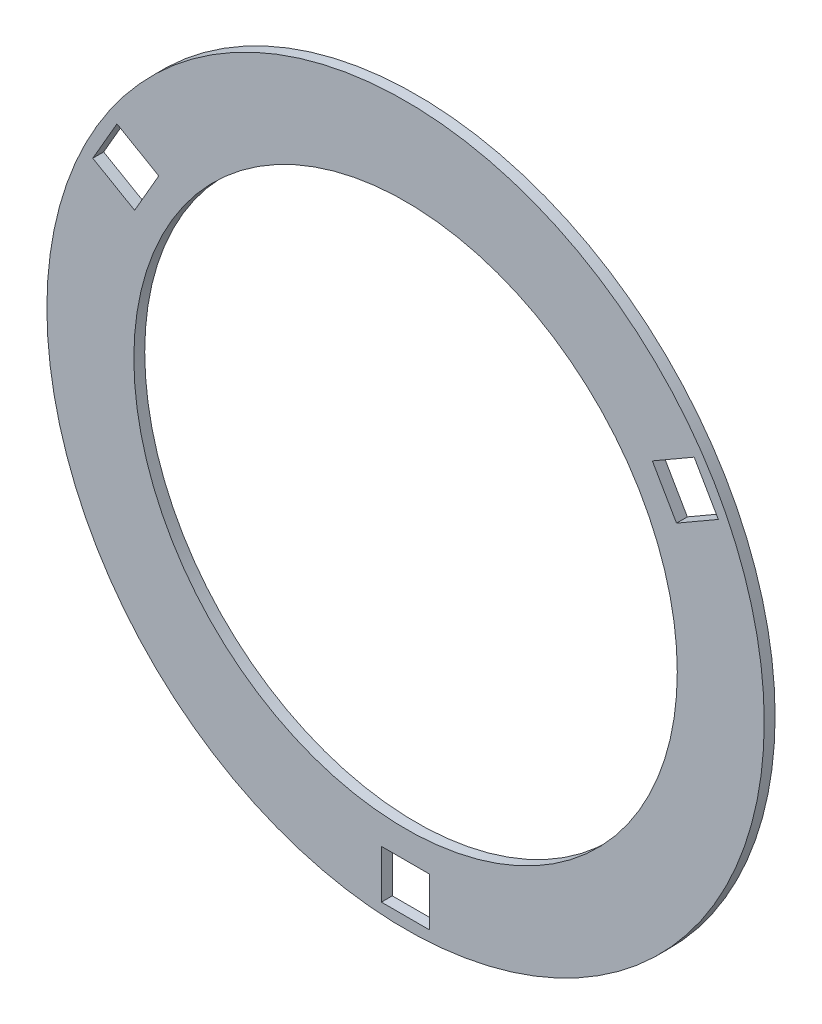
ISO-10303-21;
HEADER;
FILE_DESCRIPTION(('STEP AP214'),'2;1');
FILE_NAME('part.step','',(''),(''),'','','');
FILE_SCHEMA(('AUTOMOTIVE_DESIGN { 1 0 10303 214 1 1 1 1 }'));
ENDSEC;
DATA;
#1=APPLICATION_CONTEXT('core data for automotive mechanical design processes');
#2=APPLICATION_PROTOCOL_DEFINITION('international standard','automotive_design',2000,#1);
#3=PRODUCT_CONTEXT('',#1,'mechanical');
#4=PRODUCT('Part','Part','',(#3));
#5=PRODUCT_RELATED_PRODUCT_CATEGORY('part','',(#4));
#6=PRODUCT_DEFINITION_FORMATION('','',#4);
#7=PRODUCT_DEFINITION_CONTEXT('part definition',#1,'design');
#8=PRODUCT_DEFINITION('design','',#6,#7);
#9=PRODUCT_DEFINITION_SHAPE('','',#8);
#10=(LENGTH_UNIT() NAMED_UNIT(*) SI_UNIT(.MILLI.,.METRE.));
#11=(NAMED_UNIT(*) PLANE_ANGLE_UNIT() SI_UNIT($,.RADIAN.));
#12=(NAMED_UNIT(*) SI_UNIT($,.STERADIAN.) SOLID_ANGLE_UNIT());
#13=UNCERTAINTY_MEASURE_WITH_UNIT(LENGTH_MEASURE(1.E-05),#10,'distance_accuracy_value','');
#14=(GEOMETRIC_REPRESENTATION_CONTEXT(3) GLOBAL_UNCERTAINTY_ASSIGNED_CONTEXT((#13)) GLOBAL_UNIT_ASSIGNED_CONTEXT((#10,
#11,#12)) REPRESENTATION_CONTEXT('',''));
#15=CARTESIAN_POINT('',(0.,0.,0.));
#16=DIRECTION('',(0.,0.,1.));
#17=DIRECTION('',(1.,0.,0.));
#18=AXIS2_PLACEMENT_3D('',#15,#16,#17);
#19=CARTESIAN_POINT('',(-7.25747388281292,-45.0519952390209,10.));
#20=DIRECTION('',(0.,0.,1.));
#21=DIRECTION('',(1.,0.,0.));
#22=AXIS2_PLACEMENT_3D('',#19,#20,#21);
#23=PLANE('',#22);
#24=DIRECTION('',(-0.866025403784439,-0.5,0.));
#25=VECTOR('',#24,1.);
#26=CARTESIAN_POINT('',(258.281841356132,133.920419360085,10.));
#27=LINE('',#26,#25);
#28=CARTESIAN_POINT('',(258.281841356132,133.920419360085,10.));
#29=VERTEX_POINT('',#28);
#30=CARTESIAN_POINT('',(219.787012157914,111.695419360085,10.));
#31=VERTEX_POINT('',#30);
#32=EDGE_CURVE('E160',#29,#31,#27,.T.);
#33=ORIENTED_EDGE('',*,*,#32,.F.);
#34=DIRECTION('',(-0.5,0.866025403784439,0.));
#35=VECTOR('',#34,1.);
#36=CARTESIAN_POINT('',(280.506841356132,95.4255901618662,10.));
#37=LINE('',#36,#35);
#38=CARTESIAN_POINT('',(280.506841356132,95.4255901618662,10.));
#39=VERTEX_POINT('',#38);
#40=EDGE_CURVE('E158',#39,#29,#37,.T.);
#41=ORIENTED_EDGE('',*,*,#40,.F.);
#42=DIRECTION('',(0.866025403784439,0.5,0.));
#43=VECTOR('',#42,1.);
#44=CARTESIAN_POINT('',(242.012012157914,73.2005901618663,10.));
#45=LINE('',#44,#43);
#46=CARTESIAN_POINT('',(242.012012157914,73.2005901618662,10.));
#47=VERTEX_POINT('',#46);
#48=EDGE_CURVE('E166',#47,#39,#45,.T.);
#49=ORIENTED_EDGE('',*,*,#48,.F.);
#50=DIRECTION('',(0.5,-0.866025403784439,0.));
#51=VECTOR('',#50,1.);
#52=CARTESIAN_POINT('',(219.787012157914,111.695419360085,10.));
#53=LINE('',#52,#51);
#54=EDGE_CURVE('E163',#31,#47,#53,.T.);
#55=ORIENTED_EDGE('',*,*,#54,.F.);
#56=EDGE_LOOP('',(#33,#41,#49,#55));
#57=FACE_BOUND('',#56,.T.);
#58=CARTESIAN_POINT('',(-7.25747388281292,-45.0519952390209,10.));
#59=DIRECTION('',(0.,0.,1.));
#60=DIRECTION('',(1.,0.,0.));
#61=AXIS2_PLACEMENT_3D('',#58,#59,#60);
#62=CIRCLE('',#61,250.);
#63=CARTESIAN_POINT('',(242.742526117187,-45.0519952390209,10.));
#64=VERTEX_POINT('',#63);
#65=EDGE_CURVE('E220',#64,#64,#62,.T.);
#66=ORIENTED_EDGE('',*,*,#65,.F.);
#67=EDGE_LOOP('',(#66));
#68=FACE_BOUND('',#67,.T.);
#69=CARTESIAN_POINT('',(-7.25747388281292,-45.0519952390209,10.));
#70=DIRECTION('',(0.,0.,1.));
#71=DIRECTION('',(1.,0.,0.));
#72=AXIS2_PLACEMENT_3D('',#69,#70,#71);
#73=CIRCLE('',#72,330.);
#74=CARTESIAN_POINT('',(322.742526117187,-45.0519952390209,10.));
#75=VERTEX_POINT('',#74);
#76=EDGE_CURVE('E11',#75,#75,#73,.T.);
#77=ORIENTED_EDGE('',*,*,#76,.T.);
#78=EDGE_LOOP('',(#77));
#79=FACE_BOUND('',#78,.T.);
#80=DIRECTION('',(-0.5,-0.866025403784439,0.));
#81=VECTOR('',#80,1.);
#82=CARTESIAN_POINT('',(-272.796789121746,133.920419360092,10.));
#83=LINE('',#82,#81);
#84=CARTESIAN_POINT('',(-272.796789121746,133.920419360092,10.));
#85=VERTEX_POINT('',#84);
#86=CARTESIAN_POINT('',(-295.021789121746,95.4255901618734,10.));
#87=VERTEX_POINT('',#86);
#88=EDGE_CURVE('E191',#85,#87,#83,.T.);
#89=ORIENTED_EDGE('',*,*,#88,.F.);
#90=DIRECTION('',(-0.866025403784439,0.5,0.));
#91=VECTOR('',#90,1.);
#92=CARTESIAN_POINT('',(-234.301959923527,111.695419360092,10.));
#93=LINE('',#92,#91);
#94=CARTESIAN_POINT('',(-234.301959923527,111.695419360092,10.));
#95=VERTEX_POINT('',#94);
#96=EDGE_CURVE('E189',#95,#85,#93,.T.);
#97=ORIENTED_EDGE('',*,*,#96,.F.);
#98=DIRECTION('',(0.5,0.866025403784439,0.));
#99=VECTOR('',#98,1.);
#100=CARTESIAN_POINT('',(-256.526959923527,73.2005901618734,10.));
#101=LINE('',#100,#99);
#102=CARTESIAN_POINT('',(-256.526959923527,73.2005901618734,10.));
#103=VERTEX_POINT('',#102);
#104=EDGE_CURVE('E197',#103,#95,#101,.T.);
#105=ORIENTED_EDGE('',*,*,#104,.F.);
#106=DIRECTION('',(0.866025403784439,-0.5,0.));
#107=VECTOR('',#106,1.);
#108=CARTESIAN_POINT('',(-295.021789121746,95.4255901618734,10.));
#109=LINE('',#108,#107);
#110=EDGE_CURVE('E194',#87,#103,#109,.T.);
#111=ORIENTED_EDGE('',*,*,#110,.F.);
#112=EDGE_LOOP('',(#89,#97,#105,#111));
#113=FACE_BOUND('',#112,.T.);
#114=DIRECTION('',(0.,-1.,0.));
#115=VECTOR('',#114,1.);
#116=CARTESIAN_POINT('',(-29.4824738828129,-320.051995239021,10.));
#117=LINE('',#116,#115);
#118=CARTESIAN_POINT('',(-29.4824738828129,-320.051995239021,10.));
#119=VERTEX_POINT('',#118);
#120=CARTESIAN_POINT('',(-29.4824738828129,-364.501995239021,10.));
#121=VERTEX_POINT('',#120);
#122=EDGE_CURVE('E130',#119,#121,#117,.T.);
#123=ORIENTED_EDGE('',*,*,#122,.F.);
#124=DIRECTION('',(-1.,0.,0.));
#125=VECTOR('',#124,1.);
#126=CARTESIAN_POINT('',(14.9675261171871,-320.051995239021,10.));
#127=LINE('',#126,#125);
#128=CARTESIAN_POINT('',(14.9675261171871,-320.051995239021,10.));
#129=VERTEX_POINT('',#128);
#130=EDGE_CURVE('E122',#129,#119,#127,.T.);
#131=ORIENTED_EDGE('',*,*,#130,.F.);
#132=DIRECTION('',(0.,1.,0.));
#133=VECTOR('',#132,1.);
#134=CARTESIAN_POINT('',(14.9675261171871,-364.501995239021,10.));
#135=LINE('',#134,#133);
#136=CARTESIAN_POINT('',(14.9675261171871,-364.501995239021,10.));
#137=VERTEX_POINT('',#136);
#138=EDGE_CURVE('E144',#137,#129,#135,.T.);
#139=ORIENTED_EDGE('',*,*,#138,.F.);
#140=DIRECTION('',(1.,0.,0.));
#141=VECTOR('',#140,1.);
#142=CARTESIAN_POINT('',(-29.4824738828129,-364.501995239021,10.));
#143=LINE('',#142,#141);
#144=EDGE_CURVE('E142',#121,#137,#143,.T.);
#145=ORIENTED_EDGE('',*,*,#144,.F.);
#146=EDGE_LOOP('',(#123,#131,#139,#145));
#147=FACE_BOUND('',#146,.T.);
#148=ADVANCED_FACE('F33',(#57,#68,#79,#113,#147),#23,.T.);
#149=CARTESIAN_POINT('',(-7.25747388281292,-45.0519952390209,0.));
#150=DIRECTION('',(0.,0.,1.));
#151=DIRECTION('',(1.,0.,0.));
#152=AXIS2_PLACEMENT_3D('',#149,#150,#151);
#153=PLANE('',#152);
#154=DIRECTION('',(-0.5,0.866025403784439,0.));
#155=VECTOR('',#154,1.);
#156=CARTESIAN_POINT('',(280.506841356132,95.4255901618662,0.));
#157=LINE('',#156,#155);
#158=CARTESIAN_POINT('',(280.506841356132,95.4255901618662,0.));
#159=VERTEX_POINT('',#158);
#160=CARTESIAN_POINT('',(258.281841356132,133.920419360085,0.));
#161=VERTEX_POINT('',#160);
#162=EDGE_CURVE('E138',#159,#161,#157,.T.);
#163=ORIENTED_EDGE('',*,*,#162,.T.);
#164=DIRECTION('',(-0.866025403784439,-0.5,0.));
#165=VECTOR('',#164,1.);
#166=CARTESIAN_POINT('',(258.281841356132,133.920419360085,0.));
#167=LINE('',#166,#165);
#168=CARTESIAN_POINT('',(219.787012157914,111.695419360085,0.));
#169=VERTEX_POINT('',#168);
#170=EDGE_CURVE('E171',#161,#169,#167,.T.);
#171=ORIENTED_EDGE('',*,*,#170,.T.);
#172=DIRECTION('',(0.5,-0.866025403784439,0.));
#173=VECTOR('',#172,1.);
#174=CARTESIAN_POINT('',(219.787012157914,111.695419360085,0.));
#175=LINE('',#174,#173);
#176=CARTESIAN_POINT('',(242.012012157914,73.2005901618663,0.));
#177=VERTEX_POINT('',#176);
#178=EDGE_CURVE('E174',#169,#177,#175,.T.);
#179=ORIENTED_EDGE('',*,*,#178,.T.);
#180=DIRECTION('',(0.866025403784439,0.5,0.));
#181=VECTOR('',#180,1.);
#182=CARTESIAN_POINT('',(242.012012157914,73.2005901618663,0.));
#183=LINE('',#182,#181);
#184=EDGE_CURVE('E161',#177,#159,#183,.T.);
#185=ORIENTED_EDGE('',*,*,#184,.T.);
#186=EDGE_LOOP('',(#163,#171,#179,#185));
#187=FACE_BOUND('',#186,.T.);
#188=CARTESIAN_POINT('',(-7.25747388281292,-45.0519952390209,0.));
#189=DIRECTION('',(0.,0.,1.));
#190=DIRECTION('',(1.,0.,0.));
#191=AXIS2_PLACEMENT_3D('',#188,#189,#190);
#192=CIRCLE('',#191,250.);
#193=CARTESIAN_POINT('',(242.742526117187,-45.0519952390209,0.));
#194=VERTEX_POINT('',#193);
#195=EDGE_CURVE('E219',#194,#194,#192,.T.);
#196=ORIENTED_EDGE('',*,*,#195,.T.);
#197=EDGE_LOOP('',(#196));
#198=FACE_BOUND('',#197,.T.);
#199=CARTESIAN_POINT('',(-7.25747388281292,-45.0519952390209,0.));
#200=DIRECTION('',(0.,0.,1.));
#201=DIRECTION('',(1.,0.,0.));
#202=AXIS2_PLACEMENT_3D('',#199,#200,#201);
#203=CIRCLE('',#202,330.);
#204=CARTESIAN_POINT('',(322.742526117187,-45.0519952390209,0.));
#205=VERTEX_POINT('',#204);
#206=EDGE_CURVE('E37',#205,#205,#203,.T.);
#207=ORIENTED_EDGE('',*,*,#206,.F.);
#208=EDGE_LOOP('',(#207));
#209=FACE_BOUND('',#208,.T.);
#210=DIRECTION('',(-0.866025403784439,0.5,0.));
#211=VECTOR('',#210,1.);
#212=CARTESIAN_POINT('',(-234.301959923527,111.695419360092,0.));
#213=LINE('',#212,#211);
#214=CARTESIAN_POINT('',(-234.301959923527,111.695419360092,0.));
#215=VERTEX_POINT('',#214);
#216=CARTESIAN_POINT('',(-272.796789121746,133.920419360092,0.));
#217=VERTEX_POINT('',#216);
#218=EDGE_CURVE('E188',#215,#217,#213,.T.);
#219=ORIENTED_EDGE('',*,*,#218,.T.);
#220=DIRECTION('',(-0.5,-0.866025403784439,0.));
#221=VECTOR('',#220,1.);
#222=CARTESIAN_POINT('',(-272.796789121746,133.920419360092,0.));
#223=LINE('',#222,#221);
#224=CARTESIAN_POINT('',(-295.021789121746,95.4255901618734,0.));
#225=VERTEX_POINT('',#224);
#226=EDGE_CURVE('E202',#217,#225,#223,.T.);
#227=ORIENTED_EDGE('',*,*,#226,.T.);
#228=DIRECTION('',(0.866025403784439,-0.5,0.));
#229=VECTOR('',#228,1.);
#230=CARTESIAN_POINT('',(-295.021789121746,95.4255901618734,0.));
#231=LINE('',#230,#229);
#232=CARTESIAN_POINT('',(-256.526959923527,73.2005901618734,0.));
#233=VERTEX_POINT('',#232);
#234=EDGE_CURVE('E205',#225,#233,#231,.T.);
#235=ORIENTED_EDGE('',*,*,#234,.T.);
#236=DIRECTION('',(0.5,0.866025403784439,0.));
#237=VECTOR('',#236,1.);
#238=CARTESIAN_POINT('',(-256.526959923527,73.2005901618734,0.));
#239=LINE('',#238,#237);
#240=EDGE_CURVE('E192',#233,#215,#239,.T.);
#241=ORIENTED_EDGE('',*,*,#240,.T.);
#242=EDGE_LOOP('',(#219,#227,#235,#241));
#243=FACE_BOUND('',#242,.T.);
#244=DIRECTION('',(-1.,0.,0.));
#245=VECTOR('',#244,1.);
#246=CARTESIAN_POINT('',(14.9675261171871,-320.051995239021,0.));
#247=LINE('',#246,#245);
#248=CARTESIAN_POINT('',(14.9675261171871,-320.051995239021,0.));
#249=VERTEX_POINT('',#248);
#250=CARTESIAN_POINT('',(-29.4824738828129,-320.051995239021,0.));
#251=VERTEX_POINT('',#250);
#252=EDGE_CURVE('E56',#249,#251,#247,.T.);
#253=ORIENTED_EDGE('',*,*,#252,.T.);
#254=DIRECTION('',(0.,-1.,0.));
#255=VECTOR('',#254,1.);
#256=CARTESIAN_POINT('',(-29.4824738828129,-320.051995239021,0.));
#257=LINE('',#256,#255);
#258=CARTESIAN_POINT('',(-29.4824738828129,-364.501995239021,0.));
#259=VERTEX_POINT('',#258);
#260=EDGE_CURVE('E137',#251,#259,#257,.T.);
#261=ORIENTED_EDGE('',*,*,#260,.T.);
#262=DIRECTION('',(1.,0.,0.));
#263=VECTOR('',#262,1.);
#264=CARTESIAN_POINT('',(-29.4824738828129,-364.501995239021,0.));
#265=LINE('',#264,#263);
#266=CARTESIAN_POINT('',(14.9675261171871,-364.501995239021,0.));
#267=VERTEX_POINT('',#266);
#268=EDGE_CURVE('E150',#259,#267,#265,.T.);
#269=ORIENTED_EDGE('',*,*,#268,.T.);
#270=DIRECTION('',(0.,1.,0.));
#271=VECTOR('',#270,1.);
#272=CARTESIAN_POINT('',(14.9675261171871,-364.501995239021,0.));
#273=LINE('',#272,#271);
#274=EDGE_CURVE('E131',#267,#249,#273,.T.);
#275=ORIENTED_EDGE('',*,*,#274,.T.);
#276=EDGE_LOOP('',(#253,#261,#269,#275));
#277=FACE_BOUND('',#276,.T.);
#278=ADVANCED_FACE('F226',(#187,#198,#209,#243,#277),#153,.F.);
#279=CARTESIAN_POINT('',(-7.25747388281292,-45.0519952390209,10.));
#280=DIRECTION('',(0.,0.,-1.));
#281=DIRECTION('',(-1.,0.,0.));
#282=AXIS2_PLACEMENT_3D('',#279,#280,#281);
#283=CYLINDRICAL_SURFACE('',#282,330.);
#284=ORIENTED_EDGE('',*,*,#76,.F.);
#285=EDGE_LOOP('',(#284));
#286=FACE_BOUND('',#285,.T.);
#287=ORIENTED_EDGE('',*,*,#206,.T.);
#288=EDGE_LOOP('',(#287));
#289=FACE_BOUND('',#288,.T.);
#290=ADVANCED_FACE('F35',(#286,#289),#283,.T.);
#291=CARTESIAN_POINT('',(-7.25747388281292,-45.0519952390209,10.));
#292=DIRECTION('',(0.,0.,-1.));
#293=DIRECTION('',(-1.,0.,0.));
#294=AXIS2_PLACEMENT_3D('',#291,#292,#293);
#295=CYLINDRICAL_SURFACE('',#294,250.);
#296=ORIENTED_EDGE('',*,*,#65,.T.);
#297=EDGE_LOOP('',(#296));
#298=FACE_BOUND('',#297,.T.);
#299=ORIENTED_EDGE('',*,*,#195,.F.);
#300=EDGE_LOOP('',(#299));
#301=FACE_BOUND('',#300,.T.);
#302=ADVANCED_FACE('F229',(#298,#301),#295,.F.);
#303=CARTESIAN_POINT('',(-234.301959923527,111.695419360092,10.));
#304=DIRECTION('',(-0.5,-0.866025403784439,0.));
#305=DIRECTION('',(0.866025403784439,-0.5,0.));
#306=AXIS2_PLACEMENT_3D('',#303,#304,#305);
#307=PLANE('',#306);
#308=ORIENTED_EDGE('',*,*,#218,.F.);
#309=DIRECTION('',(0.,0.,-1.));
#310=VECTOR('',#309,1.);
#311=CARTESIAN_POINT('',(-234.301959923527,111.695419360092,10.));
#312=LINE('',#311,#310);
#313=EDGE_CURVE('E199',#95,#215,#312,.T.);
#314=ORIENTED_EDGE('',*,*,#313,.F.);
#315=ORIENTED_EDGE('',*,*,#96,.T.);
#316=DIRECTION('',(0.,0.,-1.));
#317=VECTOR('',#316,1.);
#318=CARTESIAN_POINT('',(-272.796789121746,133.920419360092,10.));
#319=LINE('',#318,#317);
#320=EDGE_CURVE('E216',#85,#217,#319,.T.);
#321=ORIENTED_EDGE('',*,*,#320,.T.);
#322=EDGE_LOOP('',(#308,#314,#315,#321));
#323=FACE_BOUND('',#322,.T.);
#324=ADVANCED_FACE('F231',(#323),#307,.T.);
#325=CARTESIAN_POINT('',(-272.796789121746,133.920419360092,10.));
#326=DIRECTION('',(0.866025403784439,-0.5,0.));
#327=DIRECTION('',(0.5,0.866025403784439,0.));
#328=AXIS2_PLACEMENT_3D('',#325,#326,#327);
#329=PLANE('',#328);
#330=ORIENTED_EDGE('',*,*,#226,.F.);
#331=ORIENTED_EDGE('',*,*,#320,.F.);
#332=ORIENTED_EDGE('',*,*,#88,.T.);
#333=DIRECTION('',(0.,0.,-1.));
#334=VECTOR('',#333,1.);
#335=CARTESIAN_POINT('',(-295.021789121746,95.4255901618734,10.));
#336=LINE('',#335,#334);
#337=EDGE_CURVE('E214',#87,#225,#336,.T.);
#338=ORIENTED_EDGE('',*,*,#337,.T.);
#339=EDGE_LOOP('',(#330,#331,#332,#338));
#340=FACE_BOUND('',#339,.T.);
#341=ADVANCED_FACE('F238',(#340),#329,.T.);
#342=CARTESIAN_POINT('',(-295.021789121746,95.4255901618734,10.));
#343=DIRECTION('',(0.5,0.866025403784439,0.));
#344=DIRECTION('',(-0.866025403784439,0.5,0.));
#345=AXIS2_PLACEMENT_3D('',#342,#343,#344);
#346=PLANE('',#345);
#347=ORIENTED_EDGE('',*,*,#234,.F.);
#348=ORIENTED_EDGE('',*,*,#337,.F.);
#349=ORIENTED_EDGE('',*,*,#110,.T.);
#350=DIRECTION('',(0.,0.,-1.));
#351=VECTOR('',#350,1.);
#352=CARTESIAN_POINT('',(-256.526959923527,73.2005901618734,10.));
#353=LINE('',#352,#351);
#354=EDGE_CURVE('E212',#103,#233,#353,.T.);
#355=ORIENTED_EDGE('',*,*,#354,.T.);
#356=EDGE_LOOP('',(#347,#348,#349,#355));
#357=FACE_BOUND('',#356,.T.);
#358=ADVANCED_FACE('F266',(#357),#346,.T.);
#359=CARTESIAN_POINT('',(-256.526959923527,73.2005901618734,10.));
#360=DIRECTION('',(-0.866025403784439,0.5,0.));
#361=DIRECTION('',(-0.5,-0.866025403784439,0.));
#362=AXIS2_PLACEMENT_3D('',#359,#360,#361);
#363=PLANE('',#362);
#364=ORIENTED_EDGE('',*,*,#240,.F.);
#365=ORIENTED_EDGE('',*,*,#354,.F.);
#366=ORIENTED_EDGE('',*,*,#104,.T.);
#367=ORIENTED_EDGE('',*,*,#313,.T.);
#368=EDGE_LOOP('',(#364,#365,#366,#367));
#369=FACE_BOUND('',#368,.T.);
#370=ADVANCED_FACE('F272',(#369),#363,.T.);
#371=CARTESIAN_POINT('',(280.506841356132,95.4255901618662,10.));
#372=DIRECTION('',(-0.866025403784439,-0.5,0.));
#373=DIRECTION('',(0.5,-0.866025403784439,0.));
#374=AXIS2_PLACEMENT_3D('',#371,#372,#373);
#375=PLANE('',#374);
#376=ORIENTED_EDGE('',*,*,#162,.F.);
#377=DIRECTION('',(0.,0.,-1.));
#378=VECTOR('',#377,1.);
#379=CARTESIAN_POINT('',(280.506841356132,95.4255901618662,10.));
#380=LINE('',#379,#378);
#381=EDGE_CURVE('E168',#39,#159,#380,.T.);
#382=ORIENTED_EDGE('',*,*,#381,.F.);
#383=ORIENTED_EDGE('',*,*,#40,.T.);
#384=DIRECTION('',(0.,0.,-1.));
#385=VECTOR('',#384,1.);
#386=CARTESIAN_POINT('',(258.281841356132,133.920419360085,10.));
#387=LINE('',#386,#385);
#388=EDGE_CURVE('E185',#29,#161,#387,.T.);
#389=ORIENTED_EDGE('',*,*,#388,.T.);
#390=EDGE_LOOP('',(#376,#382,#383,#389));
#391=FACE_BOUND('',#390,.T.);
#392=ADVANCED_FACE('F274',(#391),#375,.T.);
#393=CARTESIAN_POINT('',(258.281841356132,133.920419360085,10.));
#394=DIRECTION('',(0.5,-0.866025403784439,0.));
#395=DIRECTION('',(0.866025403784439,0.5,0.));
#396=AXIS2_PLACEMENT_3D('',#393,#394,#395);
#397=PLANE('',#396);
#398=ORIENTED_EDGE('',*,*,#170,.F.);
#399=ORIENTED_EDGE('',*,*,#388,.F.);
#400=ORIENTED_EDGE('',*,*,#32,.T.);
#401=DIRECTION('',(0.,0.,-1.));
#402=VECTOR('',#401,1.);
#403=CARTESIAN_POINT('',(219.787012157914,111.695419360085,10.));
#404=LINE('',#403,#402);
#405=EDGE_CURVE('E183',#31,#169,#404,.T.);
#406=ORIENTED_EDGE('',*,*,#405,.T.);
#407=EDGE_LOOP('',(#398,#399,#400,#406));
#408=FACE_BOUND('',#407,.T.);
#409=ADVANCED_FACE('F280',(#408),#397,.T.);
#410=CARTESIAN_POINT('',(219.787012157914,111.695419360085,10.));
#411=DIRECTION('',(0.866025403784439,0.5,0.));
#412=DIRECTION('',(-0.5,0.866025403784439,0.));
#413=AXIS2_PLACEMENT_3D('',#410,#411,#412);
#414=PLANE('',#413);
#415=ORIENTED_EDGE('',*,*,#178,.F.);
#416=ORIENTED_EDGE('',*,*,#405,.F.);
#417=ORIENTED_EDGE('',*,*,#54,.T.);
#418=DIRECTION('',(0.,0.,-1.));
#419=VECTOR('',#418,1.);
#420=CARTESIAN_POINT('',(242.012012157914,73.2005901618663,10.));
#421=LINE('',#420,#419);
#422=EDGE_CURVE('E181',#47,#177,#421,.T.);
#423=ORIENTED_EDGE('',*,*,#422,.T.);
#424=EDGE_LOOP('',(#415,#416,#417,#423));
#425=FACE_BOUND('',#424,.T.);
#426=ADVANCED_FACE('F314',(#425),#414,.T.);
#427=CARTESIAN_POINT('',(242.012012157914,73.2005901618663,10.));
#428=DIRECTION('',(-0.5,0.866025403784439,0.));
#429=DIRECTION('',(-0.866025403784439,-0.5,0.));
#430=AXIS2_PLACEMENT_3D('',#427,#428,#429);
#431=PLANE('',#430);
#432=ORIENTED_EDGE('',*,*,#184,.F.);
#433=ORIENTED_EDGE('',*,*,#422,.F.);
#434=ORIENTED_EDGE('',*,*,#48,.T.);
#435=ORIENTED_EDGE('',*,*,#381,.T.);
#436=EDGE_LOOP('',(#432,#433,#434,#435));
#437=FACE_BOUND('',#436,.T.);
#438=ADVANCED_FACE('F323',(#437),#431,.T.);
#439=CARTESIAN_POINT('',(14.9675261171871,-320.051995239021,10.));
#440=DIRECTION('',(0.,-1.,0.));
#441=DIRECTION('',(0.,0.,-1.));
#442=AXIS2_PLACEMENT_3D('',#439,#440,#441);
#443=PLANE('',#442);
#444=ORIENTED_EDGE('',*,*,#252,.F.);
#445=DIRECTION('',(0.,0.,-1.));
#446=VECTOR('',#445,1.);
#447=CARTESIAN_POINT('',(14.9675261171871,-320.051995239021,10.));
#448=LINE('',#447,#446);
#449=EDGE_CURVE('E126',#129,#249,#448,.T.);
#450=ORIENTED_EDGE('',*,*,#449,.F.);
#451=ORIENTED_EDGE('',*,*,#130,.T.);
#452=DIRECTION('',(0.,0.,-1.));
#453=VECTOR('',#452,1.);
#454=CARTESIAN_POINT('',(-29.4824738828129,-320.051995239021,10.));
#455=LINE('',#454,#453);
#456=EDGE_CURVE('E125',#119,#251,#455,.T.);
#457=ORIENTED_EDGE('',*,*,#456,.T.);
#458=EDGE_LOOP('',(#444,#450,#451,#457));
#459=FACE_BOUND('',#458,.T.);
#460=ADVANCED_FACE('F124',(#459),#443,.T.);
#461=CARTESIAN_POINT('',(-29.4824738828129,-320.051995239021,10.));
#462=DIRECTION('',(1.,0.,0.));
#463=DIRECTION('',(0.,0.,-1.));
#464=AXIS2_PLACEMENT_3D('',#461,#462,#463);
#465=PLANE('',#464);
#466=ORIENTED_EDGE('',*,*,#260,.F.);
#467=ORIENTED_EDGE('',*,*,#456,.F.);
#468=ORIENTED_EDGE('',*,*,#122,.T.);
#469=DIRECTION('',(0.,0.,-1.));
#470=VECTOR('',#469,1.);
#471=CARTESIAN_POINT('',(-29.4824738828129,-364.501995239021,10.));
#472=LINE('',#471,#470);
#473=EDGE_CURVE('E139',#121,#259,#472,.T.);
#474=ORIENTED_EDGE('',*,*,#473,.T.);
#475=EDGE_LOOP('',(#466,#467,#468,#474));
#476=FACE_BOUND('',#475,.T.);
#477=ADVANCED_FACE('F134',(#476),#465,.T.);
#478=CARTESIAN_POINT('',(-29.4824738828129,-364.501995239021,10.));
#479=DIRECTION('',(0.,1.,0.));
#480=DIRECTION('',(0.,0.,1.));
#481=AXIS2_PLACEMENT_3D('',#478,#479,#480);
#482=PLANE('',#481);
#483=ORIENTED_EDGE('',*,*,#268,.F.);
#484=ORIENTED_EDGE('',*,*,#473,.F.);
#485=ORIENTED_EDGE('',*,*,#144,.T.);
#486=DIRECTION('',(0.,0.,-1.));
#487=VECTOR('',#486,1.);
#488=CARTESIAN_POINT('',(14.9675261171871,-364.501995239021,10.));
#489=LINE('',#488,#487);
#490=EDGE_CURVE('E48',#137,#267,#489,.T.);
#491=ORIENTED_EDGE('',*,*,#490,.T.);
#492=EDGE_LOOP('',(#483,#484,#485,#491));
#493=FACE_BOUND('',#492,.T.);
#494=ADVANCED_FACE('F350',(#493),#482,.T.);
#495=CARTESIAN_POINT('',(14.9675261171871,-364.501995239021,10.));
#496=DIRECTION('',(-1.,0.,0.));
#497=DIRECTION('',(0.,0.,1.));
#498=AXIS2_PLACEMENT_3D('',#495,#496,#497);
#499=PLANE('',#498);
#500=ORIENTED_EDGE('',*,*,#274,.F.);
#501=ORIENTED_EDGE('',*,*,#490,.F.);
#502=ORIENTED_EDGE('',*,*,#138,.T.);
#503=ORIENTED_EDGE('',*,*,#449,.T.);
#504=EDGE_LOOP('',(#500,#501,#502,#503));
#505=FACE_BOUND('',#504,.T.);
#506=ADVANCED_FACE('F359',(#505),#499,.T.);
#507=CLOSED_SHELL('',(#148,#278,#290,#302,#324,#341,#358,#370,#392,#409,#426,#438,#460,#477,
#494,#506));
#508=MANIFOLD_SOLID_BREP('B2',#507);
#509=ADVANCED_BREP_SHAPE_REPRESENTATION('',(#18,#508),#14);
#510=SHAPE_DEFINITION_REPRESENTATION(#9,#509);
ENDSEC;
END-ISO-10303-21;
